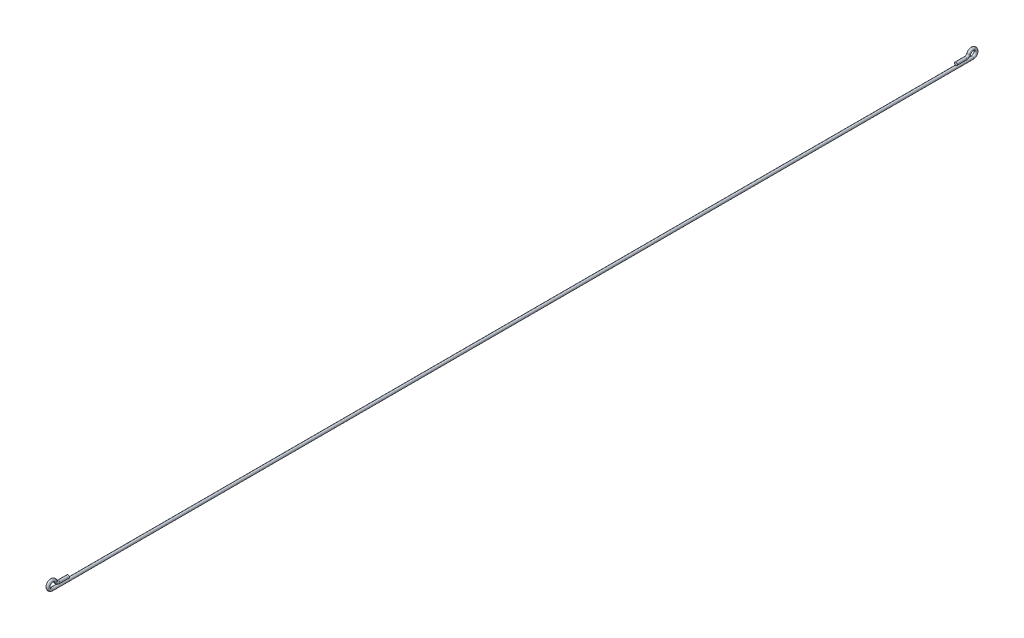
ISO-10303-21;
HEADER;
FILE_DESCRIPTION(('STEP AP214'),'2;1');
FILE_NAME('part.step','',(''),(''),'','','');
FILE_SCHEMA(('AUTOMOTIVE_DESIGN { 1 0 10303 214 1 1 1 1 }'));
ENDSEC;
DATA;
#1=APPLICATION_CONTEXT('core data for automotive mechanical design processes');
#2=APPLICATION_PROTOCOL_DEFINITION('international standard','automotive_design',2000,#1);
#3=PRODUCT_CONTEXT('',#1,'mechanical');
#4=PRODUCT('Part','Part','',(#3));
#5=PRODUCT_RELATED_PRODUCT_CATEGORY('part','',(#4));
#6=PRODUCT_DEFINITION_FORMATION('','',#4);
#7=PRODUCT_DEFINITION_CONTEXT('part definition',#1,'design');
#8=PRODUCT_DEFINITION('design','',#6,#7);
#9=PRODUCT_DEFINITION_SHAPE('','',#8);
#10=(LENGTH_UNIT() NAMED_UNIT(*) SI_UNIT(.MILLI.,.METRE.));
#11=(NAMED_UNIT(*) PLANE_ANGLE_UNIT() SI_UNIT($,.RADIAN.));
#12=(NAMED_UNIT(*) SI_UNIT($,.STERADIAN.) SOLID_ANGLE_UNIT());
#13=UNCERTAINTY_MEASURE_WITH_UNIT(LENGTH_MEASURE(1.E-05),#10,'distance_accuracy_value','');
#14=(GEOMETRIC_REPRESENTATION_CONTEXT(3) GLOBAL_UNCERTAINTY_ASSIGNED_CONTEXT((#13)) GLOBAL_UNIT_ASSIGNED_CONTEXT((#10,
#11,#12)) REPRESENTATION_CONTEXT('',''));
#15=CARTESIAN_POINT('',(0.,0.,0.));
#16=DIRECTION('',(0.,0.,1.));
#17=DIRECTION('',(1.,0.,0.));
#18=AXIS2_PLACEMENT_3D('',#15,#16,#17);
#19=CARTESIAN_POINT('',(0.,-3.,17.4161984870956));
#20=DIRECTION('',(0.,0.,-1.));
#21=DIRECTION('',(0.,1.,0.));
#22=AXIS2_PLACEMENT_3D('',#19,#20,#21);
#23=CYLINDRICAL_SURFACE('',#22,1.5);
#24=CARTESIAN_POINT('',(0.,-3.,17.4161984870956));
#25=DIRECTION('',(0.,0.,-1.));
#26=DIRECTION('',(1.,0.,0.));
#27=AXIS2_PLACEMENT_3D('',#24,#25,#26);
#28=CIRCLE('',#27,1.5);
#29=CARTESIAN_POINT('',(0.,-4.5,17.4161984870956));
#30=VERTEX_POINT('',#29);
#31=EDGE_CURVE('E10',#30,#30,#28,.T.);
#32=ORIENTED_EDGE('',*,*,#31,.T.);
#33=EDGE_LOOP('',(#32));
#34=FACE_BOUND('',#33,.T.);
#35=CARTESIAN_POINT('',(0.,-2.99999999998779,-962.583801512904));
#36=DIRECTION('',(0.,0.,-1.));
#37=DIRECTION('',(1.,0.,0.));
#38=AXIS2_PLACEMENT_3D('',#35,#36,#37);
#39=CIRCLE('',#38,1.5);
#40=CARTESIAN_POINT('',(0.,-4.49999999998773,-962.583801512904));
#41=VERTEX_POINT('',#40);
#42=EDGE_CURVE('E49',#41,#41,#39,.T.);
#43=ORIENTED_EDGE('',*,*,#42,.F.);
#44=EDGE_LOOP('',(#43));
#45=FACE_BOUND('',#44,.T.);
#46=ADVANCED_FACE('F31',(#34,#45),#23,.T.);
#47=CARTESIAN_POINT('',(0.,1.,17.4161984870957));
#48=DIRECTION('',(1.,0.,0.));
#49=DIRECTION('',(0.,0.,-1.));
#50=AXIS2_PLACEMENT_3D('',#47,#48,#49);
#51=TOROIDAL_SURFACE('',#50,4.,1.5);
#52=CARTESIAN_POINT('',(0.,2.5,13.7080992435478));
#53=DIRECTION('',(0.,0.927024810886958,0.374999999999999));
#54=DIRECTION('',(1.,0.,0.));
#55=AXIS2_PLACEMENT_3D('',#52,#53,#54);
#56=CIRCLE('',#55,1.5);
#57=CARTESIAN_POINT('',(0.,3.0625,12.3175620272174));
#58=VERTEX_POINT('',#57);
#59=EDGE_CURVE('E37',#58,#58,#56,.T.);
#60=CARTESIAN_POINT('',(0.,1.,17.4161984870957));
#61=DIRECTION('',(1.,0.,0.));
#62=DIRECTION('',(0.,0.,-1.));
#63=AXIS2_PLACEMENT_3D('',#60,#61,#62);
#64=CIRCLE('',#63,5.5);
#65=EDGE_CURVE('',#58,#30,#64,.T.);
#66=ORIENTED_EDGE('',*,*,#59,.T.);
#67=ORIENTED_EDGE('',*,*,#31,.F.);
#68=ORIENTED_EDGE('',*,*,#65,.T.);
#69=ORIENTED_EDGE('',*,*,#65,.F.);
#70=EDGE_LOOP('',(#66,#68,#67,#69));
#71=FACE_BOUND('',#70,.T.);
#72=ADVANCED_FACE('F80',(#71),#51,.T.);
#73=CARTESIAN_POINT('',(0.,4.,10.));
#74=DIRECTION('',(-1.,0.,0.));
#75=DIRECTION('',(0.,0.,1.));
#76=AXIS2_PLACEMENT_3D('',#73,#74,#75);
#77=TOROIDAL_SURFACE('',#76,4.,1.5);
#78=CARTESIAN_POINT('',(0.,0.,10.));
#79=DIRECTION('',(0.,0.,1.));
#80=DIRECTION('',(1.,0.,0.));
#81=AXIS2_PLACEMENT_3D('',#78,#79,#80);
#82=CIRCLE('',#81,1.5);
#83=CARTESIAN_POINT('',(1.5,0.,10.));
#84=VERTEX_POINT('',#83);
#85=EDGE_CURVE('E41',#84,#84,#82,.T.);
#86=ORIENTED_EDGE('',*,*,#85,.T.);
#87=EDGE_LOOP('',(#86));
#88=FACE_BOUND('',#87,.T.);
#89=ORIENTED_EDGE('',*,*,#59,.F.);
#90=EDGE_LOOP('',(#89));
#91=FACE_BOUND('',#90,.T.);
#92=ADVANCED_FACE('F84',(#88,#91),#77,.T.);
#93=CARTESIAN_POINT('',(0.,0.,10.));
#94=DIRECTION('',(0.,0.,-1.));
#95=DIRECTION('',(-1.,0.,0.));
#96=AXIS2_PLACEMENT_3D('',#93,#94,#95);
#97=CYLINDRICAL_SURFACE('',#96,1.5);
#98=ORIENTED_EDGE('',*,*,#85,.F.);
#99=EDGE_LOOP('',(#98));
#100=FACE_BOUND('',#99,.T.);
#101=CARTESIAN_POINT('',(0.,0.,0.));
#102=DIRECTION('',(0.,0.,1.));
#103=DIRECTION('',(1.,0.,0.));
#104=AXIS2_PLACEMENT_3D('',#101,#102,#103);
#105=CIRCLE('',#104,1.5);
#106=CARTESIAN_POINT('',(1.5,0.,0.));
#107=VERTEX_POINT('',#106);
#108=EDGE_CURVE('E45',#107,#107,#105,.T.);
#109=ORIENTED_EDGE('',*,*,#108,.T.);
#110=EDGE_LOOP('',(#109));
#111=FACE_BOUND('',#110,.T.);
#112=ADVANCED_FACE('F88',(#100,#111),#97,.T.);
#113=CARTESIAN_POINT('',(0.,0.,0.));
#114=DIRECTION('',(0.,0.,1.));
#115=DIRECTION('',(1.,0.,0.));
#116=AXIS2_PLACEMENT_3D('',#113,#114,#115);
#117=PLANE('',#116);
#118=ORIENTED_EDGE('',*,*,#108,.F.);
#119=EDGE_LOOP('',(#118));
#120=FACE_BOUND('',#119,.T.);
#121=ADVANCED_FACE('F75',(#120),#117,.F.);
#122=CARTESIAN_POINT('',(0.,1.00000000001229,-962.583801512904));
#123=DIRECTION('',(-1.,0.,0.));
#124=DIRECTION('',(0.,0.,1.));
#125=AXIS2_PLACEMENT_3D('',#122,#123,#124);
#126=TOROIDAL_SURFACE('',#125,4.00000000000002,1.5);
#127=CARTESIAN_POINT('',(0.,2.50000000001227,-958.875702269356));
#128=DIRECTION('',(0.,-0.927024810886967,0.374999999999979));
#129=DIRECTION('',(1.,0.,0.));
#130=AXIS2_PLACEMENT_3D('',#127,#128,#129);
#131=CIRCLE('',#130,1.5);
#132=CARTESIAN_POINT('',(0.,3.06250000001226,-957.485165053026));
#133=VERTEX_POINT('',#132);
#134=EDGE_CURVE('E53',#133,#133,#131,.T.);
#135=CARTESIAN_POINT('',(0.,1.00000000001229,-962.583801512904));
#136=DIRECTION('',(-1.,0.,0.));
#137=DIRECTION('',(0.,0.,1.));
#138=AXIS2_PLACEMENT_3D('',#135,#136,#137);
#139=CIRCLE('',#138,5.50000000000003);
#140=EDGE_CURVE('',#133,#41,#139,.T.);
#141=ORIENTED_EDGE('',*,*,#134,.F.);
#142=ORIENTED_EDGE('',*,*,#42,.T.);
#143=ORIENTED_EDGE('',*,*,#140,.T.);
#144=ORIENTED_EDGE('',*,*,#140,.F.);
#145=EDGE_LOOP('',(#141,#143,#142,#144));
#146=FACE_BOUND('',#145,.T.);
#147=ADVANCED_FACE('F69',(#146),#126,.T.);
#148=CARTESIAN_POINT('',(0.,4.00000000001211,-955.167603025808));
#149=DIRECTION('',(1.,0.,0.));
#150=DIRECTION('',(0.,0.,-1.));
#151=AXIS2_PLACEMENT_3D('',#148,#149,#150);
#152=TOROIDAL_SURFACE('',#151,4.,1.5);
#153=CARTESIAN_POINT('',(0.,1.21085296391672E-11,-955.167603025809));
#154=DIRECTION('',(0.,0.,1.));
#155=DIRECTION('',(1.,0.,0.));
#156=AXIS2_PLACEMENT_3D('',#153,#154,#155);
#157=CIRCLE('',#156,1.5);
#158=CARTESIAN_POINT('',(1.5,1.21085296391672E-11,-955.167603025809));
#159=VERTEX_POINT('',#158);
#160=EDGE_CURVE('E56',#159,#159,#157,.T.);
#161=ORIENTED_EDGE('',*,*,#160,.F.);
#162=EDGE_LOOP('',(#161));
#163=FACE_BOUND('',#162,.T.);
#164=ORIENTED_EDGE('',*,*,#134,.T.);
#165=EDGE_LOOP('',(#164));
#166=FACE_BOUND('',#165,.T.);
#167=ADVANCED_FACE('F66',(#163,#166),#152,.T.);
#168=CARTESIAN_POINT('',(0.,1.21085296391672E-11,-955.167603025809));
#169=DIRECTION('',(0.,0.,1.));
#170=DIRECTION('',(0.,-1.,0.));
#171=AXIS2_PLACEMENT_3D('',#168,#169,#170);
#172=CYLINDRICAL_SURFACE('',#171,1.5);
#173=ORIENTED_EDGE('',*,*,#160,.T.);
#174=EDGE_LOOP('',(#173));
#175=FACE_BOUND('',#174,.T.);
#176=CARTESIAN_POINT('',(0.,1.1857619235602E-11,-945.167603025809));
#177=DIRECTION('',(0.,0.,1.));
#178=DIRECTION('',(1.,0.,0.));
#179=AXIS2_PLACEMENT_3D('',#176,#177,#178);
#180=CIRCLE('',#179,1.5);
#181=CARTESIAN_POINT('',(1.5,1.1857619235602E-11,-945.167603025809));
#182=VERTEX_POINT('',#181);
#183=EDGE_CURVE('E57',#182,#182,#180,.T.);
#184=ORIENTED_EDGE('',*,*,#183,.F.);
#185=EDGE_LOOP('',(#184));
#186=FACE_BOUND('',#185,.T.);
#187=ADVANCED_FACE('F63',(#175,#186),#172,.T.);
#188=CARTESIAN_POINT('',(0.,1.1857619235602E-11,-945.167603025809));
#189=DIRECTION('',(0.,0.,-1.));
#190=DIRECTION('',(1.,0.,0.));
#191=AXIS2_PLACEMENT_3D('',#188,#189,#190);
#192=PLANE('',#191);
#193=ORIENTED_EDGE('',*,*,#183,.T.);
#194=EDGE_LOOP('',(#193));
#195=FACE_BOUND('',#194,.T.);
#196=ADVANCED_FACE('F101',(#195),#192,.F.);
#197=CLOSED_SHELL('',(#46,#72,#92,#112,#121,#147,#167,#187,#196));
#198=MANIFOLD_SOLID_BREP('B2',#197);
#199=ADVANCED_BREP_SHAPE_REPRESENTATION('',(#18,#198),#14);
#200=SHAPE_DEFINITION_REPRESENTATION(#9,#199);
ENDSEC;
END-ISO-10303-21;
